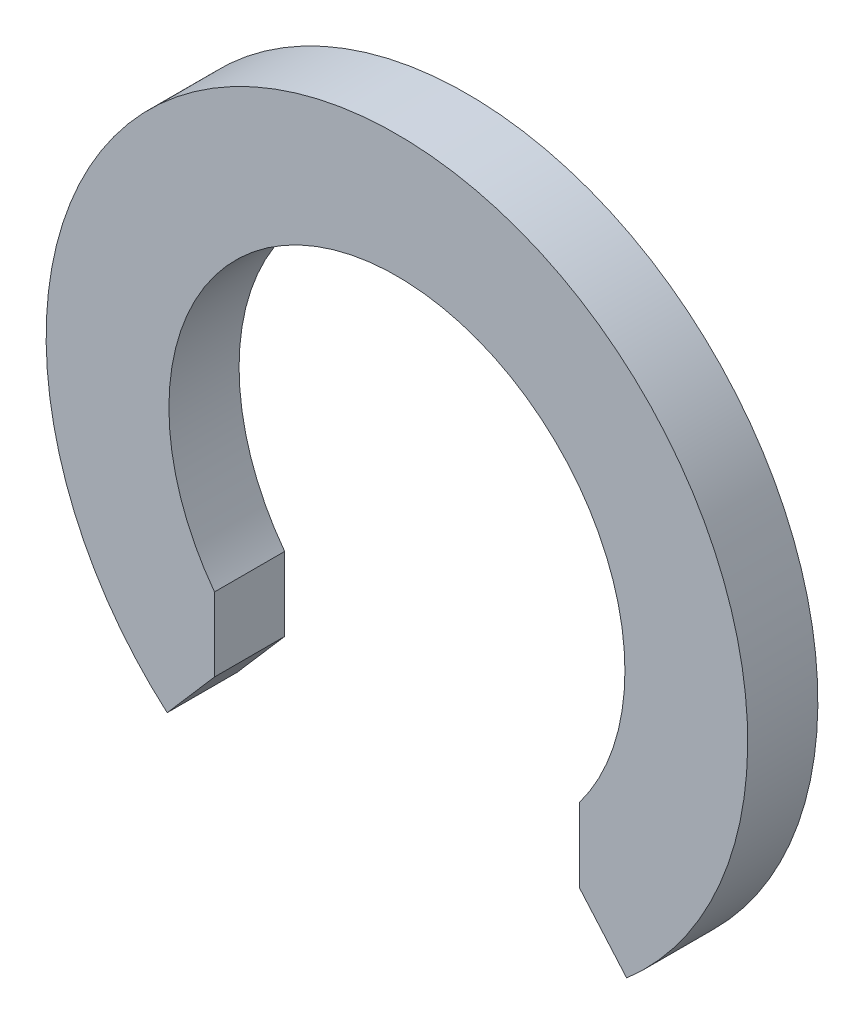
ISO-10303-21;
HEADER;
FILE_DESCRIPTION(('STEP AP214'),'2;1');
FILE_NAME('part.step','',(''),(''),'','','');
FILE_SCHEMA(('AUTOMOTIVE_DESIGN { 1 0 10303 214 1 1 1 1 }'));
ENDSEC;
DATA;
#1=APPLICATION_CONTEXT('core data for automotive mechanical design processes');
#2=APPLICATION_PROTOCOL_DEFINITION('international standard','automotive_design',2000,#1);
#3=PRODUCT_CONTEXT('',#1,'mechanical');
#4=PRODUCT('Part','Part','',(#3));
#5=PRODUCT_RELATED_PRODUCT_CATEGORY('part','',(#4));
#6=PRODUCT_DEFINITION_FORMATION('','',#4);
#7=PRODUCT_DEFINITION_CONTEXT('part definition',#1,'design');
#8=PRODUCT_DEFINITION('design','',#6,#7);
#9=PRODUCT_DEFINITION_SHAPE('','',#8);
#10=(LENGTH_UNIT() NAMED_UNIT(*) SI_UNIT(.MILLI.,.METRE.));
#11=(NAMED_UNIT(*) PLANE_ANGLE_UNIT() SI_UNIT($,.RADIAN.));
#12=(NAMED_UNIT(*) SI_UNIT($,.STERADIAN.) SOLID_ANGLE_UNIT());
#13=UNCERTAINTY_MEASURE_WITH_UNIT(LENGTH_MEASURE(1.E-05),#10,'distance_accuracy_value','');
#14=(GEOMETRIC_REPRESENTATION_CONTEXT(3) GLOBAL_UNCERTAINTY_ASSIGNED_CONTEXT((#13)) GLOBAL_UNIT_ASSIGNED_CONTEXT((#10,
#11,#12)) REPRESENTATION_CONTEXT('',''));
#15=CARTESIAN_POINT('',(0.,0.,0.));
#16=DIRECTION('',(0.,0.,1.));
#17=DIRECTION('',(1.,0.,0.));
#18=AXIS2_PLACEMENT_3D('',#15,#16,#17);
#19=CARTESIAN_POINT('',(0.,0.,1.));
#20=DIRECTION('',(0.,0.,1.));
#21=DIRECTION('',(1.,0.,0.));
#22=AXIS2_PLACEMENT_3D('',#19,#20,#21);
#23=PLANE('',#22);
#24=DIRECTION('',(0.,1.,0.));
#25=VECTOR('',#24,1.);
#26=CARTESIAN_POINT('',(2.6,0.,1.));
#27=LINE('',#26,#25);
#28=CARTESIAN_POINT('',(2.6,-3.,1.));
#29=VERTEX_POINT('',#28);
#30=CARTESIAN_POINT('',(2.6,-1.95,1.));
#31=VERTEX_POINT('',#30);
#32=EDGE_CURVE('E56',#29,#31,#27,.T.);
#33=ORIENTED_EDGE('',*,*,#32,.F.);
#34=DIRECTION('',(-0.654930538417842,0.755689082789818,0.));
#35=VECTOR('',#34,1.);
#36=CARTESIAN_POINT('',(2.6,-3.,1.));
#37=LINE('',#36,#35);
#38=CARTESIAN_POINT('',(3.27465269208921,-3.77844541394909,1.));
#39=VERTEX_POINT('',#38);
#40=EDGE_CURVE('E94',#39,#29,#37,.T.);
#41=ORIENTED_EDGE('',*,*,#40,.F.);
#42=CARTESIAN_POINT('',(0.,0.,1.));
#43=DIRECTION('',(0.,0.,1.));
#44=DIRECTION('',(1.,0.,0.));
#45=AXIS2_PLACEMENT_3D('',#42,#43,#44);
#46=CIRCLE('',#45,5.);
#47=CARTESIAN_POINT('',(-3.27465269208921,-3.77844541394909,1.));
#48=VERTEX_POINT('',#47);
#49=EDGE_CURVE('E107',#39,#48,#46,.T.);
#50=ORIENTED_EDGE('',*,*,#49,.T.);
#51=DIRECTION('',(-0.654930538417842,-0.755689082789818,0.));
#52=VECTOR('',#51,1.);
#53=CARTESIAN_POINT('',(-2.6,-3.,1.));
#54=LINE('',#53,#52);
#55=CARTESIAN_POINT('',(-2.6,-3.,1.));
#56=VERTEX_POINT('',#55);
#57=EDGE_CURVE('E89',#56,#48,#54,.T.);
#58=ORIENTED_EDGE('',*,*,#57,.F.);
#59=DIRECTION('',(0.,-1.,0.));
#60=VECTOR('',#59,1.);
#61=CARTESIAN_POINT('',(-2.6,0.,1.));
#62=LINE('',#61,#60);
#63=CARTESIAN_POINT('',(-2.6,-1.95,1.));
#64=VERTEX_POINT('',#63);
#65=EDGE_CURVE('E97',#64,#56,#62,.T.);
#66=ORIENTED_EDGE('',*,*,#65,.F.);
#67=CARTESIAN_POINT('',(0.,0.,1.));
#68=DIRECTION('',(0.,0.,1.));
#69=DIRECTION('',(1.,0.,0.));
#70=AXIS2_PLACEMENT_3D('',#67,#68,#69);
#71=CIRCLE('',#70,3.25);
#72=EDGE_CURVE('E123',#31,#64,#71,.T.);
#73=ORIENTED_EDGE('',*,*,#72,.F.);
#74=EDGE_LOOP('',(#33,#41,#50,#58,#66,#73));
#75=FACE_BOUND('',#74,.T.);
#76=ADVANCED_FACE('F33',(#75),#23,.T.);
#77=CARTESIAN_POINT('',(0.,0.,0.));
#78=DIRECTION('',(0.,0.,1.));
#79=DIRECTION('',(1.,0.,0.));
#80=AXIS2_PLACEMENT_3D('',#77,#78,#79);
#81=PLANE('',#80);
#82=DIRECTION('',(-0.654930538417842,0.755689082789818,0.));
#83=VECTOR('',#82,1.);
#84=CARTESIAN_POINT('',(0.,0.,0.));
#85=LINE('',#84,#83);
#86=CARTESIAN_POINT('',(3.27465269208921,-3.77844541394909,0.));
#87=VERTEX_POINT('',#86);
#88=CARTESIAN_POINT('',(2.6,-3.,0.));
#89=VERTEX_POINT('',#88);
#90=EDGE_CURVE('E119',#87,#89,#85,.T.);
#91=ORIENTED_EDGE('',*,*,#90,.T.);
#92=DIRECTION('',(0.,1.,0.));
#93=VECTOR('',#92,1.);
#94=CARTESIAN_POINT('',(2.6,0.,0.));
#95=LINE('',#94,#93);
#96=CARTESIAN_POINT('',(2.6,-1.95,0.));
#97=VERTEX_POINT('',#96);
#98=EDGE_CURVE('E115',#89,#97,#95,.T.);
#99=ORIENTED_EDGE('',*,*,#98,.T.);
#100=CARTESIAN_POINT('',(0.,0.,0.));
#101=DIRECTION('',(0.,0.,1.));
#102=DIRECTION('',(1.,0.,0.));
#103=AXIS2_PLACEMENT_3D('',#100,#101,#102);
#104=CIRCLE('',#103,3.25);
#105=CARTESIAN_POINT('',(-2.6,-1.95,0.));
#106=VERTEX_POINT('',#105);
#107=EDGE_CURVE('E122',#97,#106,#104,.T.);
#108=ORIENTED_EDGE('',*,*,#107,.T.);
#109=DIRECTION('',(0.,-1.,0.));
#110=VECTOR('',#109,1.);
#111=CARTESIAN_POINT('',(-2.6,0.,0.));
#112=LINE('',#111,#110);
#113=CARTESIAN_POINT('',(-2.6,-3.,0.));
#114=VERTEX_POINT('',#113);
#115=EDGE_CURVE('E48',#106,#114,#112,.T.);
#116=ORIENTED_EDGE('',*,*,#115,.T.);
#117=DIRECTION('',(-0.654930538417842,-0.755689082789818,0.));
#118=VECTOR('',#117,1.);
#119=CARTESIAN_POINT('',(0.,0.,0.));
#120=LINE('',#119,#118);
#121=CARTESIAN_POINT('',(-3.27465269208921,-3.77844541394909,0.));
#122=VERTEX_POINT('',#121);
#123=EDGE_CURVE('E92',#114,#122,#120,.T.);
#124=ORIENTED_EDGE('',*,*,#123,.T.);
#125=CARTESIAN_POINT('',(0.,0.,0.));
#126=DIRECTION('',(0.,0.,1.));
#127=DIRECTION('',(1.,0.,0.));
#128=AXIS2_PLACEMENT_3D('',#125,#126,#127);
#129=CIRCLE('',#128,5.);
#130=EDGE_CURVE('E125',#87,#122,#129,.T.);
#131=ORIENTED_EDGE('',*,*,#130,.F.);
#132=EDGE_LOOP('',(#91,#99,#108,#116,#124,#131));
#133=FACE_BOUND('',#132,.T.);
#134=ADVANCED_FACE('F136',(#133),#81,.F.);
#135=CARTESIAN_POINT('',(0.,0.,1.));
#136=DIRECTION('',(0.,0.,-1.));
#137=DIRECTION('',(-1.,0.,0.));
#138=AXIS2_PLACEMENT_3D('',#135,#136,#137);
#139=CYLINDRICAL_SURFACE('',#138,5.);
#140=ORIENTED_EDGE('',*,*,#49,.F.);
#141=DIRECTION('',(0.,0.,-1.));
#142=VECTOR('',#141,1.);
#143=CARTESIAN_POINT('',(3.27465269208921,-3.77844541394909,1.));
#144=LINE('',#143,#142);
#145=EDGE_CURVE('E11',#39,#87,#144,.T.);
#146=ORIENTED_EDGE('',*,*,#145,.T.);
#147=ORIENTED_EDGE('',*,*,#130,.T.);
#148=DIRECTION('',(0.,0.,-1.));
#149=VECTOR('',#148,1.);
#150=CARTESIAN_POINT('',(-3.27465269208921,-3.77844541394909,1.));
#151=LINE('',#150,#149);
#152=EDGE_CURVE('E41',#122,#48,#151,.F.);
#153=ORIENTED_EDGE('',*,*,#152,.T.);
#154=EDGE_LOOP('',(#140,#146,#147,#153));
#155=FACE_BOUND('',#154,.T.);
#156=ADVANCED_FACE('F35',(#155),#139,.T.);
#157=CARTESIAN_POINT('',(0.,0.,1.));
#158=DIRECTION('',(0.,0.,-1.));
#159=DIRECTION('',(-1.,0.,0.));
#160=AXIS2_PLACEMENT_3D('',#157,#158,#159);
#161=CYLINDRICAL_SURFACE('',#160,3.25);
#162=DIRECTION('',(0.,0.,-1.));
#163=VECTOR('',#162,1.);
#164=CARTESIAN_POINT('',(2.6,-1.95,1.));
#165=LINE('',#164,#163);
#166=EDGE_CURVE('E132',#31,#97,#165,.T.);
#167=ORIENTED_EDGE('',*,*,#166,.F.);
#168=ORIENTED_EDGE('',*,*,#72,.T.);
#169=DIRECTION('',(0.,0.,-1.));
#170=VECTOR('',#169,1.);
#171=CARTESIAN_POINT('',(-2.6,-1.95,1.));
#172=LINE('',#171,#170);
#173=EDGE_CURVE('E99',#106,#64,#172,.F.);
#174=ORIENTED_EDGE('',*,*,#173,.F.);
#175=ORIENTED_EDGE('',*,*,#107,.F.);
#176=EDGE_LOOP('',(#167,#168,#174,#175));
#177=FACE_BOUND('',#176,.T.);
#178=ADVANCED_FACE('F139',(#177),#161,.F.);
#179=CARTESIAN_POINT('',(-2.6,0.,-9.));
#180=DIRECTION('',(-1.,0.,0.));
#181=DIRECTION('',(0.,-1.,0.));
#182=AXIS2_PLACEMENT_3D('',#179,#180,#181);
#183=PLANE('',#182);
#184=ORIENTED_EDGE('',*,*,#173,.T.);
#185=ORIENTED_EDGE('',*,*,#65,.T.);
#186=DIRECTION('',(0.,0.,1.));
#187=VECTOR('',#186,1.);
#188=CARTESIAN_POINT('',(-2.6,-3.,-9.));
#189=LINE('',#188,#187);
#190=EDGE_CURVE('E85',#114,#56,#189,.T.);
#191=ORIENTED_EDGE('',*,*,#190,.F.);
#192=ORIENTED_EDGE('',*,*,#115,.F.);
#193=EDGE_LOOP('',(#184,#185,#191,#192));
#194=FACE_BOUND('',#193,.T.);
#195=ADVANCED_FACE('F98',(#194),#183,.F.);
#196=CARTESIAN_POINT('',(-2.6,-3.,-9.));
#197=DIRECTION('',(-0.755689082789818,0.654930538417842,0.));
#198=DIRECTION('',(-0.654930538417842,-0.755689082789818,0.));
#199=AXIS2_PLACEMENT_3D('',#196,#197,#198);
#200=PLANE('',#199);
#201=ORIENTED_EDGE('',*,*,#190,.T.);
#202=ORIENTED_EDGE('',*,*,#57,.T.);
#203=ORIENTED_EDGE('',*,*,#152,.F.);
#204=ORIENTED_EDGE('',*,*,#123,.F.);
#205=EDGE_LOOP('',(#201,#202,#203,#204));
#206=FACE_BOUND('',#205,.T.);
#207=ADVANCED_FACE('F87',(#206),#200,.F.);
#208=CARTESIAN_POINT('',(2.6,-3.,-9.));
#209=DIRECTION('',(0.755689082789818,0.654930538417842,0.));
#210=DIRECTION('',(-0.654930538417842,0.755689082789818,0.));
#211=AXIS2_PLACEMENT_3D('',#208,#209,#210);
#212=PLANE('',#211);
#213=ORIENTED_EDGE('',*,*,#145,.F.);
#214=ORIENTED_EDGE('',*,*,#40,.T.);
#215=DIRECTION('',(0.,0.,1.));
#216=VECTOR('',#215,1.);
#217=CARTESIAN_POINT('',(2.6,-3.,-9.));
#218=LINE('',#217,#216);
#219=EDGE_CURVE('E93',#89,#29,#218,.T.);
#220=ORIENTED_EDGE('',*,*,#219,.F.);
#221=ORIENTED_EDGE('',*,*,#90,.F.);
#222=EDGE_LOOP('',(#213,#214,#220,#221));
#223=FACE_BOUND('',#222,.T.);
#224=ADVANCED_FACE('F142',(#223),#212,.F.);
#225=CARTESIAN_POINT('',(2.6,0.,-9.));
#226=DIRECTION('',(1.,0.,0.));
#227=DIRECTION('',(0.,1.,0.));
#228=AXIS2_PLACEMENT_3D('',#225,#226,#227);
#229=PLANE('',#228);
#230=ORIENTED_EDGE('',*,*,#219,.T.);
#231=ORIENTED_EDGE('',*,*,#32,.T.);
#232=ORIENTED_EDGE('',*,*,#166,.T.);
#233=ORIENTED_EDGE('',*,*,#98,.F.);
#234=EDGE_LOOP('',(#230,#231,#232,#233));
#235=FACE_BOUND('',#234,.T.);
#236=ADVANCED_FACE('F143',(#235),#229,.F.);
#237=CLOSED_SHELL('',(#76,#134,#156,#178,#195,#207,#224,#236));
#238=MANIFOLD_SOLID_BREP('B2',#237);
#239=ADVANCED_BREP_SHAPE_REPRESENTATION('',(#18,#238),#14);
#240=SHAPE_DEFINITION_REPRESENTATION(#9,#239);
ENDSEC;
END-ISO-10303-21;
